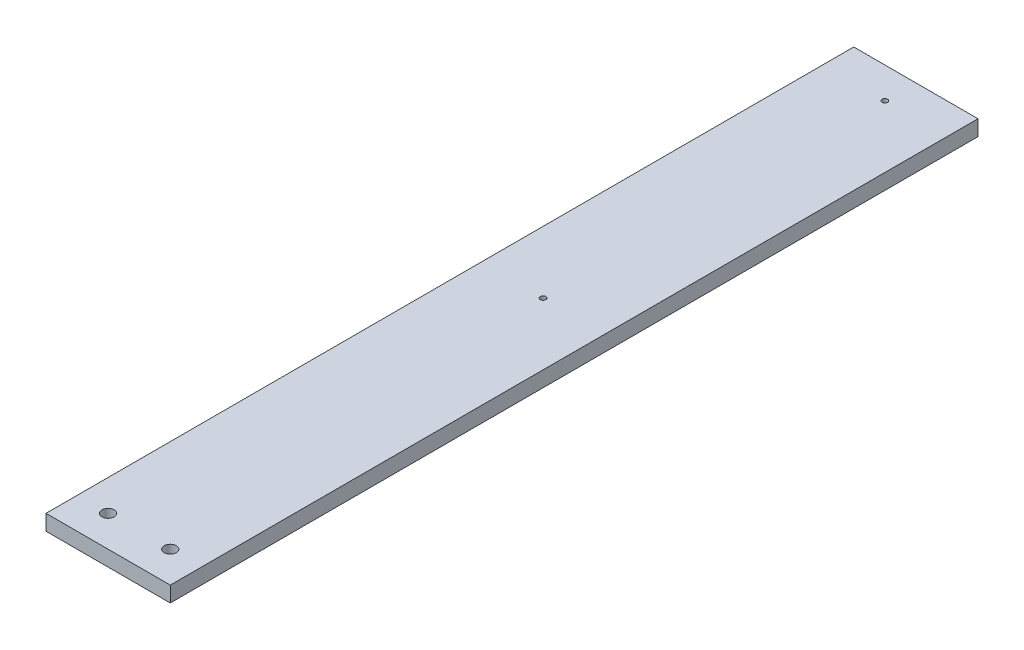
ISO-10303-21;
HEADER;
FILE_DESCRIPTION(('STEP AP214'),'2;1');
FILE_NAME('part.step','',(''),(''),'','','');
FILE_SCHEMA(('AUTOMOTIVE_DESIGN { 1 0 10303 214 1 1 1 1 }'));
ENDSEC;
DATA;
#1=APPLICATION_CONTEXT('core data for automotive mechanical design processes');
#2=APPLICATION_PROTOCOL_DEFINITION('international standard','automotive_design',2000,#1);
#3=PRODUCT_CONTEXT('',#1,'mechanical');
#4=PRODUCT('Part','Part','',(#3));
#5=PRODUCT_RELATED_PRODUCT_CATEGORY('part','',(#4));
#6=PRODUCT_DEFINITION_FORMATION('','',#4);
#7=PRODUCT_DEFINITION_CONTEXT('part definition',#1,'design');
#8=PRODUCT_DEFINITION('design','',#6,#7);
#9=PRODUCT_DEFINITION_SHAPE('','',#8);
#10=(LENGTH_UNIT() NAMED_UNIT(*) SI_UNIT(.MILLI.,.METRE.));
#11=(NAMED_UNIT(*) PLANE_ANGLE_UNIT() SI_UNIT($,.RADIAN.));
#12=(NAMED_UNIT(*) SI_UNIT($,.STERADIAN.) SOLID_ANGLE_UNIT());
#13=UNCERTAINTY_MEASURE_WITH_UNIT(LENGTH_MEASURE(1.E-05),#10,'distance_accuracy_value','');
#14=(GEOMETRIC_REPRESENTATION_CONTEXT(3) GLOBAL_UNCERTAINTY_ASSIGNED_CONTEXT((#13)) GLOBAL_UNIT_ASSIGNED_CONTEXT((#10,
#11,#12)) REPRESENTATION_CONTEXT('',''));
#15=CARTESIAN_POINT('',(0.,0.,0.));
#16=DIRECTION('',(0.,0.,1.));
#17=DIRECTION('',(1.,0.,0.));
#18=AXIS2_PLACEMENT_3D('',#15,#16,#17);
#19=CARTESIAN_POINT('',(0.,-6.35,330.2));
#20=DIRECTION('',(0.,1.,0.));
#21=DIRECTION('',(0.,0.,1.));
#22=AXIS2_PLACEMENT_3D('',#19,#20,#21);
#23=PLANE('',#22);
#24=CARTESIAN_POINT('',(25.4,-6.35,152.4));
#25=DIRECTION('',(0.,1.,0.));
#26=DIRECTION('',(0.,0.,1.));
#27=AXIS2_PLACEMENT_3D('',#24,#25,#26);
#28=CIRCLE('',#27,1.13029999999999);
#29=CARTESIAN_POINT('',(25.4,-6.35,153.5303));
#30=VERTEX_POINT('',#29);
#31=EDGE_CURVE('E131',#30,#30,#28,.T.);
#32=ORIENTED_EDGE('',*,*,#31,.T.);
#33=EDGE_LOOP('',(#32));
#34=FACE_BOUND('',#33,.T.);
#35=CARTESIAN_POINT('',(25.4,-6.35,12.7));
#36=DIRECTION('',(0.,1.,0.));
#37=DIRECTION('',(0.,0.,1.));
#38=AXIS2_PLACEMENT_3D('',#35,#36,#37);
#39=CIRCLE('',#38,1.13029999999999);
#40=CARTESIAN_POINT('',(25.4,-6.35,13.8303));
#41=VERTEX_POINT('',#40);
#42=EDGE_CURVE('E118',#41,#41,#39,.T.);
#43=ORIENTED_EDGE('',*,*,#42,.T.);
#44=EDGE_LOOP('',(#43));
#45=FACE_BOUND('',#44,.T.);
#46=CARTESIAN_POINT('',(12.7,-6.35,317.5));
#47=DIRECTION('',(0.,1.,0.));
#48=DIRECTION('',(0.,0.,1.));
#49=AXIS2_PLACEMENT_3D('',#46,#47,#48);
#50=CIRCLE('',#49,2.4892);
#51=CARTESIAN_POINT('',(12.7,-6.35,319.9892));
#52=VERTEX_POINT('',#51);
#53=EDGE_CURVE('E104',#52,#52,#50,.T.);
#54=ORIENTED_EDGE('',*,*,#53,.T.);
#55=EDGE_LOOP('',(#54));
#56=FACE_BOUND('',#55,.T.);
#57=CARTESIAN_POINT('',(38.1,-6.35,317.5));
#58=DIRECTION('',(0.,1.,0.));
#59=DIRECTION('',(0.,0.,1.));
#60=AXIS2_PLACEMENT_3D('',#57,#58,#59);
#61=CIRCLE('',#60,2.4892);
#62=CARTESIAN_POINT('',(38.1,-6.35,319.9892));
#63=VERTEX_POINT('',#62);
#64=EDGE_CURVE('E117',#63,#63,#61,.T.);
#65=ORIENTED_EDGE('',*,*,#64,.T.);
#66=EDGE_LOOP('',(#65));
#67=FACE_BOUND('',#66,.T.);
#68=DIRECTION('',(1.,0.,0.));
#69=VECTOR('',#68,1.);
#70=CARTESIAN_POINT('',(0.,-6.35,0.));
#71=LINE('',#70,#69);
#72=CARTESIAN_POINT('',(0.,-6.35,0.));
#73=VERTEX_POINT('',#72);
#74=CARTESIAN_POINT('',(50.8,-6.35,0.));
#75=VERTEX_POINT('',#74);
#76=EDGE_CURVE('E102',#73,#75,#71,.T.);
#77=ORIENTED_EDGE('',*,*,#76,.T.);
#78=DIRECTION('',(0.,0.,-1.));
#79=VECTOR('',#78,1.);
#80=CARTESIAN_POINT('',(50.8,-6.35,330.2));
#81=LINE('',#80,#79);
#82=CARTESIAN_POINT('',(50.8,-6.35,330.2));
#83=VERTEX_POINT('',#82);
#84=EDGE_CURVE('E11',#83,#75,#81,.T.);
#85=ORIENTED_EDGE('',*,*,#84,.F.);
#86=DIRECTION('',(1.,0.,0.));
#87=VECTOR('',#86,1.);
#88=CARTESIAN_POINT('',(0.,-6.35,330.2));
#89=LINE('',#88,#87);
#90=CARTESIAN_POINT('',(0.,-6.35,330.2));
#91=VERTEX_POINT('',#90);
#92=EDGE_CURVE('E79',#91,#83,#89,.T.);
#93=ORIENTED_EDGE('',*,*,#92,.F.);
#94=DIRECTION('',(0.,0.,-1.));
#95=VECTOR('',#94,1.);
#96=CARTESIAN_POINT('',(0.,-6.35,330.2));
#97=LINE('',#96,#95);
#98=EDGE_CURVE('E55',#91,#73,#97,.T.);
#99=ORIENTED_EDGE('',*,*,#98,.T.);
#100=EDGE_LOOP('',(#77,#85,#93,#99));
#101=FACE_BOUND('',#100,.T.);
#102=ADVANCED_FACE('F39',(#34,#45,#56,#67,#101),#23,.F.);
#103=CARTESIAN_POINT('',(50.8,0.,330.2));
#104=DIRECTION('',(1.,0.,0.));
#105=DIRECTION('',(0.,0.,-1.));
#106=AXIS2_PLACEMENT_3D('',#103,#104,#105);
#107=PLANE('',#106);
#108=DIRECTION('',(0.,-1.,0.));
#109=VECTOR('',#108,1.);
#110=CARTESIAN_POINT('',(50.8,0.,0.));
#111=LINE('',#110,#109);
#112=CARTESIAN_POINT('',(50.8,0.,0.));
#113=VERTEX_POINT('',#112);
#114=EDGE_CURVE('E88',#113,#75,#111,.T.);
#115=ORIENTED_EDGE('',*,*,#114,.F.);
#116=DIRECTION('',(0.,0.,-1.));
#117=VECTOR('',#116,1.);
#118=CARTESIAN_POINT('',(50.8,0.,330.2));
#119=LINE('',#118,#117);
#120=CARTESIAN_POINT('',(50.8,0.,330.2));
#121=VERTEX_POINT('',#120);
#122=EDGE_CURVE('E47',#121,#113,#119,.T.);
#123=ORIENTED_EDGE('',*,*,#122,.F.);
#124=DIRECTION('',(0.,-1.,0.));
#125=VECTOR('',#124,1.);
#126=CARTESIAN_POINT('',(50.8,0.,330.2));
#127=LINE('',#126,#125);
#128=EDGE_CURVE('E86',#121,#83,#127,.T.);
#129=ORIENTED_EDGE('',*,*,#128,.T.);
#130=ORIENTED_EDGE('',*,*,#84,.T.);
#131=EDGE_LOOP('',(#115,#123,#129,#130));
#132=FACE_BOUND('',#131,.T.);
#133=ADVANCED_FACE('F85',(#132),#107,.T.);
#134=CARTESIAN_POINT('',(0.,0.,330.2));
#135=DIRECTION('',(0.,1.,0.));
#136=DIRECTION('',(0.,0.,1.));
#137=AXIS2_PLACEMENT_3D('',#134,#135,#136);
#138=PLANE('',#137);
#139=CARTESIAN_POINT('',(25.4,0.,152.4));
#140=DIRECTION('',(0.,1.,0.));
#141=DIRECTION('',(0.,0.,1.));
#142=AXIS2_PLACEMENT_3D('',#139,#140,#141);
#143=CIRCLE('',#142,1.13029999999999);
#144=CARTESIAN_POINT('',(25.4,0.,153.5303));
#145=VERTEX_POINT('',#144);
#146=EDGE_CURVE('E134',#145,#145,#143,.T.);
#147=ORIENTED_EDGE('',*,*,#146,.F.);
#148=EDGE_LOOP('',(#147));
#149=FACE_BOUND('',#148,.T.);
#150=CARTESIAN_POINT('',(25.4,0.,12.7));
#151=DIRECTION('',(0.,1.,0.));
#152=DIRECTION('',(0.,0.,1.));
#153=AXIS2_PLACEMENT_3D('',#150,#151,#152);
#154=CIRCLE('',#153,1.13029999999999);
#155=CARTESIAN_POINT('',(25.4,0.,13.8303));
#156=VERTEX_POINT('',#155);
#157=EDGE_CURVE('E128',#156,#156,#154,.T.);
#158=ORIENTED_EDGE('',*,*,#157,.F.);
#159=EDGE_LOOP('',(#158));
#160=FACE_BOUND('',#159,.T.);
#161=CARTESIAN_POINT('',(12.7,0.,317.5));
#162=DIRECTION('',(0.,1.,0.));
#163=DIRECTION('',(0.,0.,1.));
#164=AXIS2_PLACEMENT_3D('',#161,#162,#163);
#165=CIRCLE('',#164,2.4892);
#166=CARTESIAN_POINT('',(12.7,0.,319.9892));
#167=VERTEX_POINT('',#166);
#168=EDGE_CURVE('E121',#167,#167,#165,.T.);
#169=ORIENTED_EDGE('',*,*,#168,.F.);
#170=EDGE_LOOP('',(#169));
#171=FACE_BOUND('',#170,.T.);
#172=CARTESIAN_POINT('',(38.1,0.,317.5));
#173=DIRECTION('',(0.,1.,0.));
#174=DIRECTION('',(0.,0.,1.));
#175=AXIS2_PLACEMENT_3D('',#172,#173,#174);
#176=CIRCLE('',#175,2.4892);
#177=CARTESIAN_POINT('',(38.1,0.,319.9892));
#178=VERTEX_POINT('',#177);
#179=EDGE_CURVE('E114',#178,#178,#176,.T.);
#180=ORIENTED_EDGE('',*,*,#179,.F.);
#181=EDGE_LOOP('',(#180));
#182=FACE_BOUND('',#181,.T.);
#183=DIRECTION('',(1.,0.,0.));
#184=VECTOR('',#183,1.);
#185=CARTESIAN_POINT('',(0.,0.,0.));
#186=LINE('',#185,#184);
#187=CARTESIAN_POINT('',(0.,0.,0.));
#188=VERTEX_POINT('',#187);
#189=EDGE_CURVE('E106',#188,#113,#186,.T.);
#190=ORIENTED_EDGE('',*,*,#189,.F.);
#191=DIRECTION('',(0.,0.,-1.));
#192=VECTOR('',#191,1.);
#193=CARTESIAN_POINT('',(0.,0.,330.2));
#194=LINE('',#193,#192);
#195=CARTESIAN_POINT('',(0.,0.,330.2));
#196=VERTEX_POINT('',#195);
#197=EDGE_CURVE('E68',#196,#188,#194,.T.);
#198=ORIENTED_EDGE('',*,*,#197,.F.);
#199=DIRECTION('',(1.,0.,0.));
#200=VECTOR('',#199,1.);
#201=CARTESIAN_POINT('',(0.,0.,330.2));
#202=LINE('',#201,#200);
#203=EDGE_CURVE('E94',#196,#121,#202,.T.);
#204=ORIENTED_EDGE('',*,*,#203,.T.);
#205=ORIENTED_EDGE('',*,*,#122,.T.);
#206=EDGE_LOOP('',(#190,#198,#204,#205));
#207=FACE_BOUND('',#206,.T.);
#208=ADVANCED_FACE('F96',(#149,#160,#171,#182,#207),#138,.T.);
#209=CARTESIAN_POINT('',(0.,-6.35,330.2));
#210=DIRECTION('',(-1.,0.,0.));
#211=DIRECTION('',(0.,0.,1.));
#212=AXIS2_PLACEMENT_3D('',#209,#210,#211);
#213=PLANE('',#212);
#214=DIRECTION('',(0.,1.,0.));
#215=VECTOR('',#214,1.);
#216=CARTESIAN_POINT('',(0.,-6.35,0.));
#217=LINE('',#216,#215);
#218=EDGE_CURVE('E108',#73,#188,#217,.T.);
#219=ORIENTED_EDGE('',*,*,#218,.F.);
#220=ORIENTED_EDGE('',*,*,#98,.F.);
#221=DIRECTION('',(0.,1.,0.));
#222=VECTOR('',#221,1.);
#223=CARTESIAN_POINT('',(0.,-6.35,330.2));
#224=LINE('',#223,#222);
#225=EDGE_CURVE('E97',#91,#196,#224,.T.);
#226=ORIENTED_EDGE('',*,*,#225,.T.);
#227=ORIENTED_EDGE('',*,*,#197,.T.);
#228=EDGE_LOOP('',(#219,#220,#226,#227));
#229=FACE_BOUND('',#228,.T.);
#230=ADVANCED_FACE('F143',(#229),#213,.T.);
#231=CARTESIAN_POINT('',(0.,0.,330.2));
#232=DIRECTION('',(0.,0.,-1.));
#233=DIRECTION('',(-1.,0.,0.));
#234=AXIS2_PLACEMENT_3D('',#231,#232,#233);
#235=PLANE('',#234);
#236=ORIENTED_EDGE('',*,*,#92,.T.);
#237=ORIENTED_EDGE('',*,*,#128,.F.);
#238=ORIENTED_EDGE('',*,*,#203,.F.);
#239=ORIENTED_EDGE('',*,*,#225,.F.);
#240=EDGE_LOOP('',(#236,#237,#238,#239));
#241=FACE_BOUND('',#240,.T.);
#242=ADVANCED_FACE('F93',(#241),#235,.F.);
#243=CARTESIAN_POINT('',(0.,0.,0.));
#244=DIRECTION('',(0.,0.,-1.));
#245=DIRECTION('',(-1.,0.,0.));
#246=AXIS2_PLACEMENT_3D('',#243,#244,#245);
#247=PLANE('',#246);
#248=ORIENTED_EDGE('',*,*,#76,.F.);
#249=ORIENTED_EDGE('',*,*,#218,.T.);
#250=ORIENTED_EDGE('',*,*,#189,.T.);
#251=ORIENTED_EDGE('',*,*,#114,.T.);
#252=EDGE_LOOP('',(#248,#249,#250,#251));
#253=FACE_BOUND('',#252,.T.);
#254=ADVANCED_FACE('F154',(#253),#247,.T.);
#255=CARTESIAN_POINT('',(38.1,-6.35,317.5));
#256=DIRECTION('',(0.,1.,0.));
#257=DIRECTION('',(0.,0.,1.));
#258=AXIS2_PLACEMENT_3D('',#255,#256,#257);
#259=CYLINDRICAL_SURFACE('',#258,2.4892);
#260=ORIENTED_EDGE('',*,*,#64,.F.);
#261=EDGE_LOOP('',(#260));
#262=FACE_BOUND('',#261,.T.);
#263=ORIENTED_EDGE('',*,*,#179,.T.);
#264=EDGE_LOOP('',(#263));
#265=FACE_BOUND('',#264,.T.);
#266=ADVANCED_FACE('F151',(#262,#265),#259,.F.);
#267=CARTESIAN_POINT('',(12.7,-6.35,317.5));
#268=DIRECTION('',(0.,1.,0.));
#269=DIRECTION('',(0.,0.,1.));
#270=AXIS2_PLACEMENT_3D('',#267,#268,#269);
#271=CYLINDRICAL_SURFACE('',#270,2.4892);
#272=ORIENTED_EDGE('',*,*,#53,.F.);
#273=EDGE_LOOP('',(#272));
#274=FACE_BOUND('',#273,.T.);
#275=ORIENTED_EDGE('',*,*,#168,.T.);
#276=EDGE_LOOP('',(#275));
#277=FACE_BOUND('',#276,.T.);
#278=ADVANCED_FACE('F153',(#274,#277),#271,.F.);
#279=CARTESIAN_POINT('',(25.4,0.,12.7));
#280=DIRECTION('',(0.,1.,0.));
#281=DIRECTION('',(0.,0.,1.));
#282=AXIS2_PLACEMENT_3D('',#279,#280,#281);
#283=CYLINDRICAL_SURFACE('',#282,1.13029999999999);
#284=ORIENTED_EDGE('',*,*,#157,.T.);
#285=EDGE_LOOP('',(#284));
#286=FACE_BOUND('',#285,.T.);
#287=ORIENTED_EDGE('',*,*,#42,.F.);
#288=EDGE_LOOP('',(#287));
#289=FACE_BOUND('',#288,.T.);
#290=ADVANCED_FACE('F161',(#286,#289),#283,.F.);
#291=CARTESIAN_POINT('',(25.4,0.,152.4));
#292=DIRECTION('',(0.,1.,0.));
#293=DIRECTION('',(0.,0.,1.));
#294=AXIS2_PLACEMENT_3D('',#291,#292,#293);
#295=CYLINDRICAL_SURFACE('',#294,1.13029999999999);
#296=ORIENTED_EDGE('',*,*,#146,.T.);
#297=EDGE_LOOP('',(#296));
#298=FACE_BOUND('',#297,.T.);
#299=ORIENTED_EDGE('',*,*,#31,.F.);
#300=EDGE_LOOP('',(#299));
#301=FACE_BOUND('',#300,.T.);
#302=ADVANCED_FACE('F138',(#298,#301),#295,.F.);
#303=CLOSED_SHELL('',(#102,#133,#208,#230,#242,#254,#266,#278,#290,#302));
#304=MANIFOLD_SOLID_BREP('B2',#303);
#305=ADVANCED_BREP_SHAPE_REPRESENTATION('',(#18,#304),#14);
#306=SHAPE_DEFINITION_REPRESENTATION(#9,#305);
ENDSEC;
END-ISO-10303-21;
